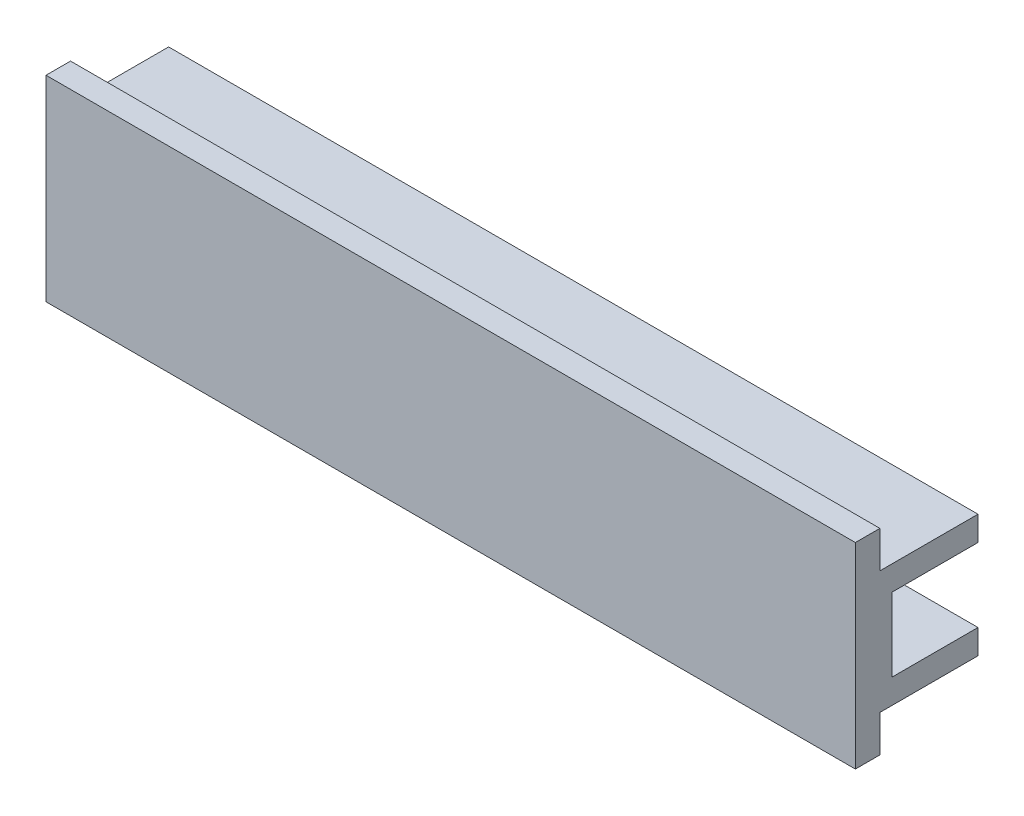
ISO-10303-21;
HEADER;
FILE_DESCRIPTION(('STEP AP214'),'2;1');
FILE_NAME('part.step','',(''),(''),'','','');
FILE_SCHEMA(('AUTOMOTIVE_DESIGN { 1 0 10303 214 1 1 1 1 }'));
ENDSEC;
DATA;
#1=APPLICATION_CONTEXT('core data for automotive mechanical design processes');
#2=APPLICATION_PROTOCOL_DEFINITION('international standard','automotive_design',2000,#1);
#3=PRODUCT_CONTEXT('',#1,'mechanical');
#4=PRODUCT('Part','Part','',(#3));
#5=PRODUCT_RELATED_PRODUCT_CATEGORY('part','',(#4));
#6=PRODUCT_DEFINITION_FORMATION('','',#4);
#7=PRODUCT_DEFINITION_CONTEXT('part definition',#1,'design');
#8=PRODUCT_DEFINITION('design','',#6,#7);
#9=PRODUCT_DEFINITION_SHAPE('','',#8);
#10=(LENGTH_UNIT() NAMED_UNIT(*) SI_UNIT(.MILLI.,.METRE.));
#11=(NAMED_UNIT(*) PLANE_ANGLE_UNIT() SI_UNIT($,.RADIAN.));
#12=(NAMED_UNIT(*) SI_UNIT($,.STERADIAN.) SOLID_ANGLE_UNIT());
#13=UNCERTAINTY_MEASURE_WITH_UNIT(LENGTH_MEASURE(1.E-05),#10,'distance_accuracy_value','');
#14=(GEOMETRIC_REPRESENTATION_CONTEXT(3) GLOBAL_UNCERTAINTY_ASSIGNED_CONTEXT((#13)) GLOBAL_UNIT_ASSIGNED_CONTEXT((#10,
#11,#12)) REPRESENTATION_CONTEXT('',''));
#15=CARTESIAN_POINT('',(0.,0.,0.));
#16=DIRECTION('',(0.,0.,1.));
#17=DIRECTION('',(1.,0.,0.));
#18=AXIS2_PLACEMENT_3D('',#15,#16,#17);
#19=CARTESIAN_POINT('',(33.,8.,5.));
#20=DIRECTION('',(0.,0.,-1.));
#21=DIRECTION('',(-1.,0.,0.));
#22=AXIS2_PLACEMENT_3D('',#19,#20,#21);
#23=PLANE('',#22);
#24=DIRECTION('',(0.,-1.,0.));
#25=VECTOR('',#24,1.);
#26=CARTESIAN_POINT('',(-33.,8.,5.));
#27=LINE('',#26,#25);
#28=CARTESIAN_POINT('',(-33.,8.,5.));
#29=VERTEX_POINT('',#28);
#30=CARTESIAN_POINT('',(-33.,-8.,5.));
#31=VERTEX_POINT('',#30);
#32=EDGE_CURVE('E148',#29,#31,#27,.T.);
#33=ORIENTED_EDGE('',*,*,#32,.T.);
#34=DIRECTION('',(-1.,0.,0.));
#35=VECTOR('',#34,1.);
#36=CARTESIAN_POINT('',(33.,-8.,5.));
#37=LINE('',#36,#35);
#38=CARTESIAN_POINT('',(33.,-8.,5.));
#39=VERTEX_POINT('',#38);
#40=EDGE_CURVE('E11',#39,#31,#37,.T.);
#41=ORIENTED_EDGE('',*,*,#40,.F.);
#42=DIRECTION('',(0.,-1.,0.));
#43=VECTOR('',#42,1.);
#44=CARTESIAN_POINT('',(33.,8.,5.));
#45=LINE('',#44,#43);
#46=CARTESIAN_POINT('',(33.,8.,5.));
#47=VERTEX_POINT('',#46);
#48=EDGE_CURVE('E170',#47,#39,#45,.T.);
#49=ORIENTED_EDGE('',*,*,#48,.F.);
#50=DIRECTION('',(-1.,0.,0.));
#51=VECTOR('',#50,1.);
#52=CARTESIAN_POINT('',(33.,8.,5.));
#53=LINE('',#52,#51);
#54=EDGE_CURVE('E144',#47,#29,#53,.T.);
#55=ORIENTED_EDGE('',*,*,#54,.T.);
#56=EDGE_LOOP('',(#33,#41,#49,#55));
#57=FACE_BOUND('',#56,.T.);
#58=ADVANCED_FACE('F30',(#57),#23,.F.);
#59=CARTESIAN_POINT('',(33.,-8.,5.));
#60=DIRECTION('',(0.,1.,0.));
#61=DIRECTION('',(0.,0.,1.));
#62=AXIS2_PLACEMENT_3D('',#59,#60,#61);
#63=PLANE('',#62);
#64=DIRECTION('',(0.,0.,-1.));
#65=VECTOR('',#64,1.);
#66=CARTESIAN_POINT('',(-33.,-8.,5.));
#67=LINE('',#66,#65);
#68=CARTESIAN_POINT('',(-33.,-8.,3.));
#69=VERTEX_POINT('',#68);
#70=EDGE_CURVE('E151',#31,#69,#67,.T.);
#71=ORIENTED_EDGE('',*,*,#70,.T.);
#72=DIRECTION('',(-1.,0.,0.));
#73=VECTOR('',#72,1.);
#74=CARTESIAN_POINT('',(33.,-8.,3.));
#75=LINE('',#74,#73);
#76=CARTESIAN_POINT('',(33.,-8.,3.));
#77=VERTEX_POINT('',#76);
#78=EDGE_CURVE('E38',#77,#69,#75,.T.);
#79=ORIENTED_EDGE('',*,*,#78,.F.);
#80=DIRECTION('',(0.,0.,-1.));
#81=VECTOR('',#80,1.);
#82=CARTESIAN_POINT('',(33.,-8.,5.));
#83=LINE('',#82,#81);
#84=EDGE_CURVE('E96',#39,#77,#83,.T.);
#85=ORIENTED_EDGE('',*,*,#84,.F.);
#86=ORIENTED_EDGE('',*,*,#40,.T.);
#87=EDGE_LOOP('',(#71,#79,#85,#86));
#88=FACE_BOUND('',#87,.T.);
#89=ADVANCED_FACE('F249',(#88),#63,.F.);
#90=CARTESIAN_POINT('',(33.,-5.,3.));
#91=DIRECTION('',(0.,0.,1.));
#92=DIRECTION('',(0.,-1.,0.));
#93=AXIS2_PLACEMENT_3D('',#90,#91,#92);
#94=PLANE('',#93);
#95=DIRECTION('',(0.,1.,0.));
#96=VECTOR('',#95,1.);
#97=CARTESIAN_POINT('',(-33.,-5.,3.));
#98=LINE('',#97,#96);
#99=CARTESIAN_POINT('',(-33.,-5.,3.));
#100=VERTEX_POINT('',#99);
#101=EDGE_CURVE('E154',#69,#100,#98,.T.);
#102=ORIENTED_EDGE('',*,*,#101,.T.);
#103=DIRECTION('',(-1.,0.,0.));
#104=VECTOR('',#103,1.);
#105=CARTESIAN_POINT('',(33.,-5.,3.));
#106=LINE('',#105,#104);
#107=CARTESIAN_POINT('',(33.,-5.,3.));
#108=VERTEX_POINT('',#107);
#109=EDGE_CURVE('E189',#108,#100,#106,.T.);
#110=ORIENTED_EDGE('',*,*,#109,.F.);
#111=DIRECTION('',(0.,1.,0.));
#112=VECTOR('',#111,1.);
#113=CARTESIAN_POINT('',(33.,-5.,3.));
#114=LINE('',#113,#112);
#115=EDGE_CURVE('E197',#77,#108,#114,.T.);
#116=ORIENTED_EDGE('',*,*,#115,.F.);
#117=ORIENTED_EDGE('',*,*,#78,.T.);
#118=EDGE_LOOP('',(#102,#110,#116,#117));
#119=FACE_BOUND('',#118,.T.);
#120=ADVANCED_FACE('F195',(#119),#94,.F.);
#121=CARTESIAN_POINT('',(33.,-5.,-5.));
#122=DIRECTION('',(0.,1.,0.));
#123=DIRECTION('',(0.,0.,1.));
#124=AXIS2_PLACEMENT_3D('',#121,#122,#123);
#125=PLANE('',#124);
#126=DIRECTION('',(0.,0.,-1.));
#127=VECTOR('',#126,1.);
#128=CARTESIAN_POINT('',(-33.,-5.,-5.));
#129=LINE('',#128,#127);
#130=CARTESIAN_POINT('',(-33.,-5.,-5.));
#131=VERTEX_POINT('',#130);
#132=EDGE_CURVE('E156',#100,#131,#129,.T.);
#133=ORIENTED_EDGE('',*,*,#132,.T.);
#134=DIRECTION('',(-1.,0.,0.));
#135=VECTOR('',#134,1.);
#136=CARTESIAN_POINT('',(33.,-5.,-5.));
#137=LINE('',#136,#135);
#138=CARTESIAN_POINT('',(33.,-5.,-5.));
#139=VERTEX_POINT('',#138);
#140=EDGE_CURVE('E186',#139,#131,#137,.T.);
#141=ORIENTED_EDGE('',*,*,#140,.F.);
#142=DIRECTION('',(0.,0.,-1.));
#143=VECTOR('',#142,1.);
#144=CARTESIAN_POINT('',(33.,-5.,-5.));
#145=LINE('',#144,#143);
#146=EDGE_CURVE('E216',#108,#139,#145,.T.);
#147=ORIENTED_EDGE('',*,*,#146,.F.);
#148=ORIENTED_EDGE('',*,*,#109,.T.);
#149=EDGE_LOOP('',(#133,#141,#147,#148));
#150=FACE_BOUND('',#149,.T.);
#151=ADVANCED_FACE('F207',(#150),#125,.F.);
#152=CARTESIAN_POINT('',(33.,-3.,-5.));
#153=DIRECTION('',(0.,0.,1.));
#154=DIRECTION('',(1.,0.,0.));
#155=AXIS2_PLACEMENT_3D('',#152,#153,#154);
#156=PLANE('',#155);
#157=DIRECTION('',(0.,1.,0.));
#158=VECTOR('',#157,1.);
#159=CARTESIAN_POINT('',(-33.,-3.,-5.));
#160=LINE('',#159,#158);
#161=CARTESIAN_POINT('',(-33.,-3.,-5.));
#162=VERTEX_POINT('',#161);
#163=EDGE_CURVE('E158',#131,#162,#160,.T.);
#164=ORIENTED_EDGE('',*,*,#163,.T.);
#165=DIRECTION('',(-1.,0.,0.));
#166=VECTOR('',#165,1.);
#167=CARTESIAN_POINT('',(33.,-3.,-5.));
#168=LINE('',#167,#166);
#169=CARTESIAN_POINT('',(33.,-3.,-5.));
#170=VERTEX_POINT('',#169);
#171=EDGE_CURVE('E183',#170,#162,#168,.T.);
#172=ORIENTED_EDGE('',*,*,#171,.F.);
#173=DIRECTION('',(0.,1.,0.));
#174=VECTOR('',#173,1.);
#175=CARTESIAN_POINT('',(33.,-3.,-5.));
#176=LINE('',#175,#174);
#177=EDGE_CURVE('E213',#139,#170,#176,.T.);
#178=ORIENTED_EDGE('',*,*,#177,.F.);
#179=ORIENTED_EDGE('',*,*,#140,.T.);
#180=EDGE_LOOP('',(#164,#172,#178,#179));
#181=FACE_BOUND('',#180,.T.);
#182=ADVANCED_FACE('F211',(#181),#156,.F.);
#183=CARTESIAN_POINT('',(33.,-3.,2.));
#184=DIRECTION('',(0.,-1.,0.));
#185=DIRECTION('',(0.,0.,-1.));
#186=AXIS2_PLACEMENT_3D('',#183,#184,#185);
#187=PLANE('',#186);
#188=DIRECTION('',(0.,0.,1.));
#189=VECTOR('',#188,1.);
#190=CARTESIAN_POINT('',(-33.,-3.,2.));
#191=LINE('',#190,#189);
#192=CARTESIAN_POINT('',(-33.,-3.,3.));
#193=VERTEX_POINT('',#192);
#194=EDGE_CURVE('E160',#162,#193,#191,.T.);
#195=ORIENTED_EDGE('',*,*,#194,.T.);
#196=DIRECTION('',(-1.,0.,0.));
#197=VECTOR('',#196,1.);
#198=CARTESIAN_POINT('',(23.5,-3.,3.));
#199=LINE('',#198,#197);
#200=CARTESIAN_POINT('',(23.5,-3.,3.));
#201=VERTEX_POINT('',#200);
#202=EDGE_CURVE('E361',#201,#193,#199,.T.);
#203=ORIENTED_EDGE('',*,*,#202,.F.);
#204=DIRECTION('',(0.,0.,1.));
#205=VECTOR('',#204,1.);
#206=CARTESIAN_POINT('',(23.5,-3.,3.));
#207=LINE('',#206,#205);
#208=CARTESIAN_POINT('',(23.5,-3.,2.));
#209=VERTEX_POINT('',#208);
#210=EDGE_CURVE('E362',#209,#201,#207,.T.);
#211=ORIENTED_EDGE('',*,*,#210,.F.);
#212=DIRECTION('',(-1.,0.,0.));
#213=VECTOR('',#212,1.);
#214=CARTESIAN_POINT('',(33.,-3.,2.));
#215=LINE('',#214,#213);
#216=CARTESIAN_POINT('',(33.,-3.,2.));
#217=VERTEX_POINT('',#216);
#218=EDGE_CURVE('E180',#217,#209,#215,.T.);
#219=ORIENTED_EDGE('',*,*,#218,.F.);
#220=DIRECTION('',(0.,0.,1.));
#221=VECTOR('',#220,1.);
#222=CARTESIAN_POINT('',(33.,-3.,2.));
#223=LINE('',#222,#221);
#224=EDGE_CURVE('E215',#170,#217,#223,.T.);
#225=ORIENTED_EDGE('',*,*,#224,.F.);
#226=ORIENTED_EDGE('',*,*,#171,.T.);
#227=EDGE_LOOP('',(#195,#203,#211,#219,#225,#226));
#228=FACE_BOUND('',#227,.T.);
#229=ADVANCED_FACE('F262',(#228),#187,.F.);
#230=CARTESIAN_POINT('',(33.,3.,2.));
#231=DIRECTION('',(0.,0.,1.));
#232=DIRECTION('',(0.,-1.,0.));
#233=AXIS2_PLACEMENT_3D('',#230,#231,#232);
#234=PLANE('',#233);
#235=ORIENTED_EDGE('',*,*,#218,.T.);
#236=CARTESIAN_POINT('',(23.5,0.,2.));
#237=DIRECTION('',(0.,0.,-1.));
#238=DIRECTION('',(0.,1.,0.));
#239=AXIS2_PLACEMENT_3D('',#236,#237,#238);
#240=CIRCLE('',#239,3.);
#241=CARTESIAN_POINT('',(23.5,3.,2.));
#242=VERTEX_POINT('',#241);
#243=EDGE_CURVE('E354',#242,#209,#240,.T.);
#244=ORIENTED_EDGE('',*,*,#243,.F.);
#245=DIRECTION('',(-1.,0.,0.));
#246=VECTOR('',#245,1.);
#247=CARTESIAN_POINT('',(33.,3.,2.));
#248=LINE('',#247,#246);
#249=CARTESIAN_POINT('',(33.,3.,2.));
#250=VERTEX_POINT('',#249);
#251=EDGE_CURVE('E177',#250,#242,#248,.T.);
#252=ORIENTED_EDGE('',*,*,#251,.F.);
#253=DIRECTION('',(0.,1.,0.));
#254=VECTOR('',#253,1.);
#255=CARTESIAN_POINT('',(33.,3.,2.));
#256=LINE('',#255,#254);
#257=EDGE_CURVE('E218',#217,#250,#256,.T.);
#258=ORIENTED_EDGE('',*,*,#257,.F.);
#259=EDGE_LOOP('',(#235,#244,#252,#258));
#260=FACE_BOUND('',#259,.T.);
#261=ADVANCED_FACE('F265',(#260),#234,.F.);
#262=CARTESIAN_POINT('',(33.,3.,-5.));
#263=DIRECTION('',(0.,1.,0.));
#264=DIRECTION('',(0.,0.,1.));
#265=AXIS2_PLACEMENT_3D('',#262,#263,#264);
#266=PLANE('',#265);
#267=DIRECTION('',(0.,0.,-1.));
#268=VECTOR('',#267,1.);
#269=CARTESIAN_POINT('',(-33.,3.,-5.));
#270=LINE('',#269,#268);
#271=CARTESIAN_POINT('',(-33.,3.,3.));
#272=VERTEX_POINT('',#271);
#273=CARTESIAN_POINT('',(-33.,3.,-5.));
#274=VERTEX_POINT('',#273);
#275=EDGE_CURVE('E163',#272,#274,#270,.T.);
#276=ORIENTED_EDGE('',*,*,#275,.T.);
#277=DIRECTION('',(-1.,0.,0.));
#278=VECTOR('',#277,1.);
#279=CARTESIAN_POINT('',(33.,3.,-5.));
#280=LINE('',#279,#278);
#281=CARTESIAN_POINT('',(33.,3.,-5.));
#282=VERTEX_POINT('',#281);
#283=EDGE_CURVE('E174',#282,#274,#280,.T.);
#284=ORIENTED_EDGE('',*,*,#283,.F.);
#285=DIRECTION('',(0.,0.,-1.));
#286=VECTOR('',#285,1.);
#287=CARTESIAN_POINT('',(33.,3.,-5.));
#288=LINE('',#287,#286);
#289=EDGE_CURVE('E224',#250,#282,#288,.T.);
#290=ORIENTED_EDGE('',*,*,#289,.F.);
#291=ORIENTED_EDGE('',*,*,#251,.T.);
#292=DIRECTION('',(0.,0.,-1.));
#293=VECTOR('',#292,1.);
#294=CARTESIAN_POINT('',(23.5,3.,2.));
#295=LINE('',#294,#293);
#296=CARTESIAN_POINT('',(23.5,3.,3.));
#297=VERTEX_POINT('',#296);
#298=EDGE_CURVE('E350',#297,#242,#295,.T.);
#299=ORIENTED_EDGE('',*,*,#298,.F.);
#300=DIRECTION('',(-1.,0.,0.));
#301=VECTOR('',#300,1.);
#302=CARTESIAN_POINT('',(23.5,3.,3.));
#303=LINE('',#302,#301);
#304=EDGE_CURVE('E152',#297,#272,#303,.T.);
#305=ORIENTED_EDGE('',*,*,#304,.T.);
#306=EDGE_LOOP('',(#276,#284,#290,#291,#299,#305));
#307=FACE_BOUND('',#306,.T.);
#308=ADVANCED_FACE('F230',(#307),#266,.F.);
#309=CARTESIAN_POINT('',(33.,5.,-5.));
#310=DIRECTION('',(0.,0.,1.));
#311=DIRECTION('',(1.,0.,0.));
#312=AXIS2_PLACEMENT_3D('',#309,#310,#311);
#313=PLANE('',#312);
#314=DIRECTION('',(0.,1.,0.));
#315=VECTOR('',#314,1.);
#316=CARTESIAN_POINT('',(-33.,5.,-5.));
#317=LINE('',#316,#315);
#318=CARTESIAN_POINT('',(-33.,5.,-5.));
#319=VERTEX_POINT('',#318);
#320=EDGE_CURVE('E165',#274,#319,#317,.T.);
#321=ORIENTED_EDGE('',*,*,#320,.T.);
#322=DIRECTION('',(-1.,0.,0.));
#323=VECTOR('',#322,1.);
#324=CARTESIAN_POINT('',(33.,5.,-5.));
#325=LINE('',#324,#323);
#326=CARTESIAN_POINT('',(33.,5.,-5.));
#327=VERTEX_POINT('',#326);
#328=EDGE_CURVE('E139',#327,#319,#325,.T.);
#329=ORIENTED_EDGE('',*,*,#328,.F.);
#330=DIRECTION('',(0.,1.,0.));
#331=VECTOR('',#330,1.);
#332=CARTESIAN_POINT('',(33.,5.,-5.));
#333=LINE('',#332,#331);
#334=EDGE_CURVE('E130',#282,#327,#333,.T.);
#335=ORIENTED_EDGE('',*,*,#334,.F.);
#336=ORIENTED_EDGE('',*,*,#283,.T.);
#337=EDGE_LOOP('',(#321,#329,#335,#336));
#338=FACE_BOUND('',#337,.T.);
#339=ADVANCED_FACE('F234',(#338),#313,.F.);
#340=CARTESIAN_POINT('',(33.,5.,3.));
#341=DIRECTION('',(0.,-1.,0.));
#342=DIRECTION('',(0.,0.,-1.));
#343=AXIS2_PLACEMENT_3D('',#340,#341,#342);
#344=PLANE('',#343);
#345=DIRECTION('',(0.,0.,1.));
#346=VECTOR('',#345,1.);
#347=CARTESIAN_POINT('',(-33.,5.,3.));
#348=LINE('',#347,#346);
#349=CARTESIAN_POINT('',(-33.,5.,3.));
#350=VERTEX_POINT('',#349);
#351=EDGE_CURVE('E138',#319,#350,#348,.T.);
#352=ORIENTED_EDGE('',*,*,#351,.T.);
#353=DIRECTION('',(-1.,0.,0.));
#354=VECTOR('',#353,1.);
#355=CARTESIAN_POINT('',(33.,5.,3.));
#356=LINE('',#355,#354);
#357=CARTESIAN_POINT('',(33.,5.,3.));
#358=VERTEX_POINT('',#357);
#359=EDGE_CURVE('E135',#358,#350,#356,.T.);
#360=ORIENTED_EDGE('',*,*,#359,.F.);
#361=DIRECTION('',(0.,0.,1.));
#362=VECTOR('',#361,1.);
#363=CARTESIAN_POINT('',(33.,5.,3.));
#364=LINE('',#363,#362);
#365=EDGE_CURVE('E124',#327,#358,#364,.T.);
#366=ORIENTED_EDGE('',*,*,#365,.F.);
#367=ORIENTED_EDGE('',*,*,#328,.T.);
#368=EDGE_LOOP('',(#352,#360,#366,#367));
#369=FACE_BOUND('',#368,.T.);
#370=ADVANCED_FACE('F136',(#369),#344,.F.);
#371=CARTESIAN_POINT('',(33.,8.,3.));
#372=DIRECTION('',(0.,0.,1.));
#373=DIRECTION('',(0.,-1.,0.));
#374=AXIS2_PLACEMENT_3D('',#371,#372,#373);
#375=PLANE('',#374);
#376=DIRECTION('',(0.,1.,0.));
#377=VECTOR('',#376,1.);
#378=CARTESIAN_POINT('',(-33.,8.,3.));
#379=LINE('',#378,#377);
#380=CARTESIAN_POINT('',(-33.,8.,3.));
#381=VERTEX_POINT('',#380);
#382=EDGE_CURVE('E82',#350,#381,#379,.T.);
#383=ORIENTED_EDGE('',*,*,#382,.T.);
#384=DIRECTION('',(-1.,0.,0.));
#385=VECTOR('',#384,1.);
#386=CARTESIAN_POINT('',(33.,8.,3.));
#387=LINE('',#386,#385);
#388=CARTESIAN_POINT('',(33.,8.,3.));
#389=VERTEX_POINT('',#388);
#390=EDGE_CURVE('E140',#389,#381,#387,.T.);
#391=ORIENTED_EDGE('',*,*,#390,.F.);
#392=DIRECTION('',(0.,1.,0.));
#393=VECTOR('',#392,1.);
#394=CARTESIAN_POINT('',(33.,8.,3.));
#395=LINE('',#394,#393);
#396=EDGE_CURVE('E128',#358,#389,#395,.T.);
#397=ORIENTED_EDGE('',*,*,#396,.F.);
#398=ORIENTED_EDGE('',*,*,#359,.T.);
#399=EDGE_LOOP('',(#383,#391,#397,#398));
#400=FACE_BOUND('',#399,.T.);
#401=ADVANCED_FACE('F142',(#400),#375,.F.);
#402=CARTESIAN_POINT('',(33.,8.,5.));
#403=DIRECTION('',(0.,-1.,0.));
#404=DIRECTION('',(0.,0.,-1.));
#405=AXIS2_PLACEMENT_3D('',#402,#403,#404);
#406=PLANE('',#405);
#407=DIRECTION('',(0.,0.,1.));
#408=VECTOR('',#407,1.);
#409=CARTESIAN_POINT('',(-33.,8.,5.));
#410=LINE('',#409,#408);
#411=EDGE_CURVE('E88',#381,#29,#410,.T.);
#412=ORIENTED_EDGE('',*,*,#411,.T.);
#413=ORIENTED_EDGE('',*,*,#54,.F.);
#414=DIRECTION('',(0.,0.,1.));
#415=VECTOR('',#414,1.);
#416=CARTESIAN_POINT('',(33.,8.,5.));
#417=LINE('',#416,#415);
#418=EDGE_CURVE('E46',#389,#47,#417,.T.);
#419=ORIENTED_EDGE('',*,*,#418,.F.);
#420=ORIENTED_EDGE('',*,*,#390,.T.);
#421=EDGE_LOOP('',(#412,#413,#419,#420));
#422=FACE_BOUND('',#421,.T.);
#423=ADVANCED_FACE('F238',(#422),#406,.F.);
#424=CARTESIAN_POINT('',(33.,-8.,5.));
#425=DIRECTION('',(1.,0.,0.));
#426=DIRECTION('',(0.,0.,-1.));
#427=AXIS2_PLACEMENT_3D('',#424,#425,#426);
#428=PLANE('',#427);
#429=ORIENTED_EDGE('',*,*,#48,.T.);
#430=ORIENTED_EDGE('',*,*,#84,.T.);
#431=ORIENTED_EDGE('',*,*,#115,.T.);
#432=ORIENTED_EDGE('',*,*,#146,.T.);
#433=ORIENTED_EDGE('',*,*,#177,.T.);
#434=ORIENTED_EDGE('',*,*,#224,.T.);
#435=ORIENTED_EDGE('',*,*,#257,.T.);
#436=ORIENTED_EDGE('',*,*,#289,.T.);
#437=ORIENTED_EDGE('',*,*,#334,.T.);
#438=ORIENTED_EDGE('',*,*,#365,.T.);
#439=ORIENTED_EDGE('',*,*,#396,.T.);
#440=ORIENTED_EDGE('',*,*,#418,.T.);
#441=EDGE_LOOP('',(#429,#430,#431,#432,#433,#434,#435,#436,#437,#438,#439,#440));
#442=FACE_BOUND('',#441,.T.);
#443=ADVANCED_FACE('F126',(#442),#428,.T.);
#444=CARTESIAN_POINT('',(-33.,-8.,5.));
#445=DIRECTION('',(1.,0.,0.));
#446=DIRECTION('',(0.,0.,-1.));
#447=AXIS2_PLACEMENT_3D('',#444,#445,#446);
#448=PLANE('',#447);
#449=ORIENTED_EDGE('',*,*,#275,.F.);
#450=DIRECTION('',(0.,1.,0.));
#451=VECTOR('',#450,1.);
#452=CARTESIAN_POINT('',(-33.,3.,3.));
#453=LINE('',#452,#451);
#454=EDGE_CURVE('E366',#193,#272,#453,.T.);
#455=ORIENTED_EDGE('',*,*,#454,.F.);
#456=ORIENTED_EDGE('',*,*,#194,.F.);
#457=ORIENTED_EDGE('',*,*,#163,.F.);
#458=ORIENTED_EDGE('',*,*,#132,.F.);
#459=ORIENTED_EDGE('',*,*,#101,.F.);
#460=ORIENTED_EDGE('',*,*,#70,.F.);
#461=ORIENTED_EDGE('',*,*,#32,.F.);
#462=ORIENTED_EDGE('',*,*,#411,.F.);
#463=ORIENTED_EDGE('',*,*,#382,.F.);
#464=ORIENTED_EDGE('',*,*,#351,.F.);
#465=ORIENTED_EDGE('',*,*,#320,.F.);
#466=EDGE_LOOP('',(#449,#455,#456,#457,#458,#459,#460,#461,#462,#463,#464,#465));
#467=FACE_BOUND('',#466,.T.);
#468=ADVANCED_FACE('F201',(#467),#448,.F.);
#469=CARTESIAN_POINT('',(23.5,3.,3.));
#470=DIRECTION('',(0.,0.,1.));
#471=DIRECTION('',(0.,-1.,0.));
#472=AXIS2_PLACEMENT_3D('',#469,#470,#471);
#473=PLANE('',#472);
#474=ORIENTED_EDGE('',*,*,#454,.T.);
#475=ORIENTED_EDGE('',*,*,#304,.F.);
#476=CARTESIAN_POINT('',(23.5,0.,3.));
#477=DIRECTION('',(0.,0.,1.));
#478=DIRECTION('',(0.,-1.,0.));
#479=AXIS2_PLACEMENT_3D('',#476,#477,#478);
#480=CIRCLE('',#479,3.);
#481=EDGE_CURVE('E357',#297,#201,#480,.F.);
#482=ORIENTED_EDGE('',*,*,#481,.T.);
#483=ORIENTED_EDGE('',*,*,#202,.T.);
#484=EDGE_LOOP('',(#474,#475,#482,#483));
#485=FACE_BOUND('',#484,.T.);
#486=ADVANCED_FACE('F302',(#485),#473,.F.);
#487=CARTESIAN_POINT('',(23.5,0.,9.70820393249937));
#488=DIRECTION('',(0.,0.,-1.));
#489=DIRECTION('',(0.,1.,0.));
#490=AXIS2_PLACEMENT_3D('',#487,#488,#489);
#491=CYLINDRICAL_SURFACE('',#490,3.);
#492=ORIENTED_EDGE('',*,*,#298,.T.);
#493=ORIENTED_EDGE('',*,*,#243,.T.);
#494=ORIENTED_EDGE('',*,*,#210,.T.);
#495=ORIENTED_EDGE('',*,*,#481,.F.);
#496=EDGE_LOOP('',(#492,#493,#494,#495));
#497=FACE_BOUND('',#496,.T.);
#498=ADVANCED_FACE('F331',(#497),#491,.F.);
#499=CLOSED_SHELL('',(#58,#89,#120,#151,#182,#229,#261,#308,#339,#370,#401,#423,#443,#468,#486,#498));
#500=MANIFOLD_SOLID_BREP('B2',#499);
#501=ADVANCED_BREP_SHAPE_REPRESENTATION('',(#18,#500),#14);
#502=SHAPE_DEFINITION_REPRESENTATION(#9,#501);
ENDSEC;
END-ISO-10303-21;
